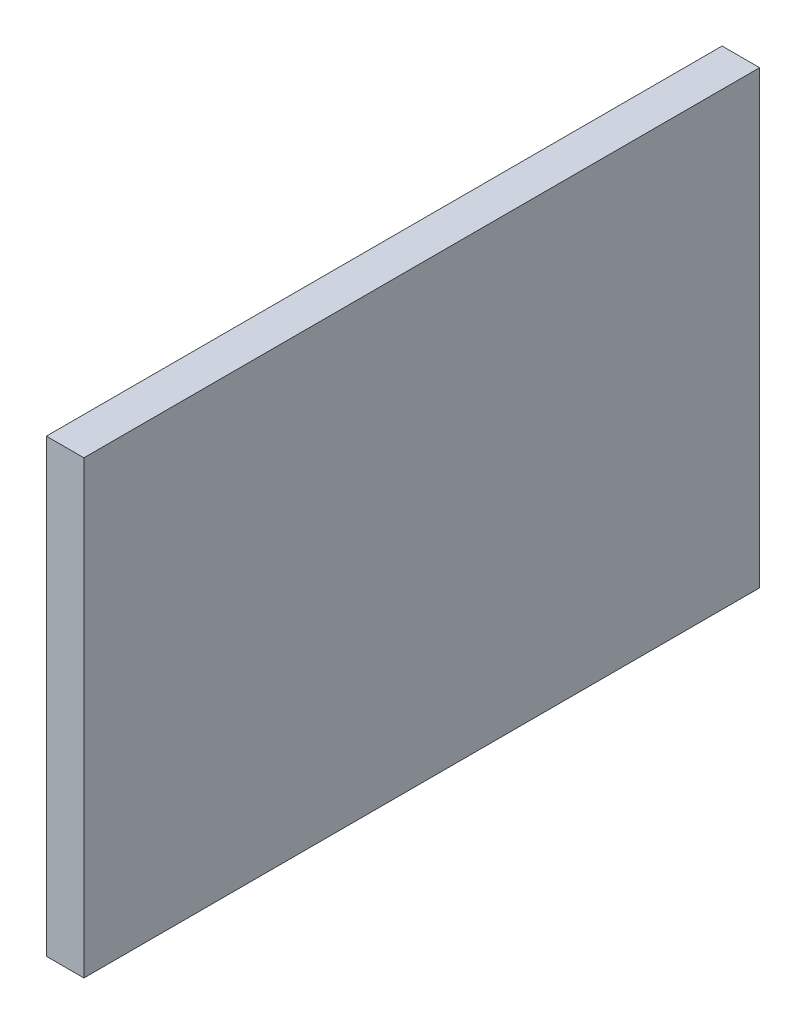
ISO-10303-21;
HEADER;
FILE_DESCRIPTION(('STEP AP214'),'2;1');
FILE_NAME('part.step','',(''),(''),'','','');
FILE_SCHEMA(('AUTOMOTIVE_DESIGN { 1 0 10303 214 1 1 1 1 }'));
ENDSEC;
DATA;
#1=APPLICATION_CONTEXT('core data for automotive mechanical design processes');
#2=APPLICATION_PROTOCOL_DEFINITION('international standard','automotive_design',2000,#1);
#3=PRODUCT_CONTEXT('',#1,'mechanical');
#4=PRODUCT('Part','Part','',(#3));
#5=PRODUCT_RELATED_PRODUCT_CATEGORY('part','',(#4));
#6=PRODUCT_DEFINITION_FORMATION('','',#4);
#7=PRODUCT_DEFINITION_CONTEXT('part definition',#1,'design');
#8=PRODUCT_DEFINITION('design','',#6,#7);
#9=PRODUCT_DEFINITION_SHAPE('','',#8);
#10=(LENGTH_UNIT() NAMED_UNIT(*) SI_UNIT(.MILLI.,.METRE.));
#11=(NAMED_UNIT(*) PLANE_ANGLE_UNIT() SI_UNIT($,.RADIAN.));
#12=(NAMED_UNIT(*) SI_UNIT($,.STERADIAN.) SOLID_ANGLE_UNIT());
#13=UNCERTAINTY_MEASURE_WITH_UNIT(LENGTH_MEASURE(1.E-05),#10,'distance_accuracy_value','');
#14=(GEOMETRIC_REPRESENTATION_CONTEXT(3) GLOBAL_UNCERTAINTY_ASSIGNED_CONTEXT((#13)) GLOBAL_UNIT_ASSIGNED_CONTEXT((#10,
#11,#12)) REPRESENTATION_CONTEXT('',''));
#15=CARTESIAN_POINT('',(0.,0.,0.));
#16=DIRECTION('',(0.,0.,1.));
#17=DIRECTION('',(1.,0.,0.));
#18=AXIS2_PLACEMENT_3D('',#15,#16,#17);
#19=CARTESIAN_POINT('',(38.1,-280.476808726494,0.));
#20=DIRECTION('',(0.,0.,-1.));
#21=DIRECTION('',(-1.,0.,0.));
#22=AXIS2_PLACEMENT_3D('',#19,#20,#21);
#23=PLANE('',#22);
#24=DIRECTION('',(0.,-1.,0.));
#25=VECTOR('',#24,1.);
#26=CARTESIAN_POINT('',(0.,-280.476808726494,0.));
#27=LINE('',#26,#25);
#28=CARTESIAN_POINT('',(0.,0.,0.));
#29=VERTEX_POINT('',#28);
#30=CARTESIAN_POINT('',(0.,-457.2,0.));
#31=VERTEX_POINT('',#30);
#32=EDGE_CURVE('E101',#29,#31,#27,.T.);
#33=ORIENTED_EDGE('',*,*,#32,.F.);
#34=DIRECTION('',(-1.,0.,0.));
#35=VECTOR('',#34,1.);
#36=CARTESIAN_POINT('',(38.1,0.,0.));
#37=LINE('',#36,#35);
#38=CARTESIAN_POINT('',(38.1,0.,0.));
#39=VERTEX_POINT('',#38);
#40=EDGE_CURVE('E10',#39,#29,#37,.T.);
#41=ORIENTED_EDGE('',*,*,#40,.F.);
#42=DIRECTION('',(0.,-1.,0.));
#43=VECTOR('',#42,1.);
#44=CARTESIAN_POINT('',(38.1,-280.476808726494,0.));
#45=LINE('',#44,#43);
#46=CARTESIAN_POINT('',(38.1,-457.2,0.));
#47=VERTEX_POINT('',#46);
#48=EDGE_CURVE('E79',#39,#47,#45,.T.);
#49=ORIENTED_EDGE('',*,*,#48,.T.);
#50=DIRECTION('',(-1.,0.,0.));
#51=VECTOR('',#50,1.);
#52=CARTESIAN_POINT('',(38.1,-457.2,0.));
#53=LINE('',#52,#51);
#54=EDGE_CURVE('E38',#47,#31,#53,.T.);
#55=ORIENTED_EDGE('',*,*,#54,.T.);
#56=EDGE_LOOP('',(#33,#41,#49,#55));
#57=FACE_BOUND('',#56,.T.);
#58=ADVANCED_FACE('F16',(#57),#23,.T.);
#59=CARTESIAN_POINT('',(38.1,0.,342.9));
#60=DIRECTION('',(0.,-1.,0.));
#61=DIRECTION('',(0.,0.,-1.));
#62=AXIS2_PLACEMENT_3D('',#59,#60,#61);
#63=PLANE('',#62);
#64=DIRECTION('',(0.,0.,1.));
#65=VECTOR('',#64,1.);
#66=CARTESIAN_POINT('',(0.,0.,342.9));
#67=LINE('',#66,#65);
#68=CARTESIAN_POINT('',(0.,0.,685.8));
#69=VERTEX_POINT('',#68);
#70=EDGE_CURVE('E86',#29,#69,#67,.T.);
#71=ORIENTED_EDGE('',*,*,#70,.T.);
#72=DIRECTION('',(-1.,0.,0.));
#73=VECTOR('',#72,1.);
#74=CARTESIAN_POINT('',(38.1,0.,685.8));
#75=LINE('',#74,#73);
#76=CARTESIAN_POINT('',(38.1,0.,685.8));
#77=VERTEX_POINT('',#76);
#78=EDGE_CURVE('E25',#77,#69,#75,.T.);
#79=ORIENTED_EDGE('',*,*,#78,.F.);
#80=DIRECTION('',(0.,0.,1.));
#81=VECTOR('',#80,1.);
#82=CARTESIAN_POINT('',(38.1,0.,342.9));
#83=LINE('',#82,#81);
#84=EDGE_CURVE('E73',#39,#77,#83,.T.);
#85=ORIENTED_EDGE('',*,*,#84,.F.);
#86=ORIENTED_EDGE('',*,*,#40,.T.);
#87=EDGE_LOOP('',(#71,#79,#85,#86));
#88=FACE_BOUND('',#87,.T.);
#89=ADVANCED_FACE('F84',(#88),#63,.F.);
#90=CARTESIAN_POINT('',(38.1,-280.476808726494,685.8));
#91=DIRECTION('',(0.,0.,-1.));
#92=DIRECTION('',(-1.,0.,0.));
#93=AXIS2_PLACEMENT_3D('',#90,#91,#92);
#94=PLANE('',#93);
#95=DIRECTION('',(0.,-1.,0.));
#96=VECTOR('',#95,1.);
#97=CARTESIAN_POINT('',(0.,-280.476808726494,685.8));
#98=LINE('',#97,#96);
#99=CARTESIAN_POINT('',(0.,-457.2,685.8));
#100=VERTEX_POINT('',#99);
#101=EDGE_CURVE('E105',#69,#100,#98,.T.);
#102=ORIENTED_EDGE('',*,*,#101,.T.);
#103=DIRECTION('',(-1.,0.,0.));
#104=VECTOR('',#103,1.);
#105=CARTESIAN_POINT('',(38.1,-457.2,685.8));
#106=LINE('',#105,#104);
#107=CARTESIAN_POINT('',(38.1,-457.2,685.8));
#108=VERTEX_POINT('',#107);
#109=EDGE_CURVE('E57',#108,#100,#106,.T.);
#110=ORIENTED_EDGE('',*,*,#109,.F.);
#111=DIRECTION('',(0.,-1.,0.));
#112=VECTOR('',#111,1.);
#113=CARTESIAN_POINT('',(38.1,-280.476808726494,685.8));
#114=LINE('',#113,#112);
#115=EDGE_CURVE('E78',#77,#108,#114,.T.);
#116=ORIENTED_EDGE('',*,*,#115,.F.);
#117=ORIENTED_EDGE('',*,*,#78,.T.);
#118=EDGE_LOOP('',(#102,#110,#116,#117));
#119=FACE_BOUND('',#118,.T.);
#120=ADVANCED_FACE('F90',(#119),#94,.F.);
#121=CARTESIAN_POINT('',(38.1,-457.2,342.9));
#122=DIRECTION('',(0.,-1.,0.));
#123=DIRECTION('',(0.,0.,-1.));
#124=AXIS2_PLACEMENT_3D('',#121,#122,#123);
#125=PLANE('',#124);
#126=DIRECTION('',(0.,0.,1.));
#127=VECTOR('',#126,1.);
#128=CARTESIAN_POINT('',(0.,-457.2,342.9));
#129=LINE('',#128,#127);
#130=EDGE_CURVE('E107',#31,#100,#129,.T.);
#131=ORIENTED_EDGE('',*,*,#130,.F.);
#132=ORIENTED_EDGE('',*,*,#54,.F.);
#133=DIRECTION('',(0.,0.,1.));
#134=VECTOR('',#133,1.);
#135=CARTESIAN_POINT('',(38.1,-457.2,342.9));
#136=LINE('',#135,#134);
#137=EDGE_CURVE('E92',#47,#108,#136,.T.);
#138=ORIENTED_EDGE('',*,*,#137,.T.);
#139=ORIENTED_EDGE('',*,*,#109,.T.);
#140=EDGE_LOOP('',(#131,#132,#138,#139));
#141=FACE_BOUND('',#140,.T.);
#142=ADVANCED_FACE('F122',(#141),#125,.T.);
#143=CARTESIAN_POINT('',(38.1,-228.6,342.9));
#144=DIRECTION('',(1.,0.,0.));
#145=DIRECTION('',(0.,1.,0.));
#146=AXIS2_PLACEMENT_3D('',#143,#144,#145);
#147=PLANE('',#146);
#148=ORIENTED_EDGE('',*,*,#48,.F.);
#149=ORIENTED_EDGE('',*,*,#84,.T.);
#150=ORIENTED_EDGE('',*,*,#115,.T.);
#151=ORIENTED_EDGE('',*,*,#137,.F.);
#152=EDGE_LOOP('',(#148,#149,#150,#151));
#153=FACE_BOUND('',#152,.T.);
#154=ADVANCED_FACE('F75',(#153),#147,.T.);
#155=CARTESIAN_POINT('',(0.,-228.6,342.9));
#156=DIRECTION('',(1.,0.,0.));
#157=DIRECTION('',(0.,1.,0.));
#158=AXIS2_PLACEMENT_3D('',#155,#156,#157);
#159=PLANE('',#158);
#160=ORIENTED_EDGE('',*,*,#32,.T.);
#161=ORIENTED_EDGE('',*,*,#130,.T.);
#162=ORIENTED_EDGE('',*,*,#101,.F.);
#163=ORIENTED_EDGE('',*,*,#70,.F.);
#164=EDGE_LOOP('',(#160,#161,#162,#163));
#165=FACE_BOUND('',#164,.T.);
#166=ADVANCED_FACE('F129',(#165),#159,.F.);
#167=CLOSED_SHELL('',(#58,#89,#120,#142,#154,#166));
#168=MANIFOLD_SOLID_BREP('B1',#167);
#169=ADVANCED_BREP_SHAPE_REPRESENTATION('',(#18,#168),#14);
#170=SHAPE_DEFINITION_REPRESENTATION(#9,#169);
ENDSEC;
END-ISO-10303-21;
